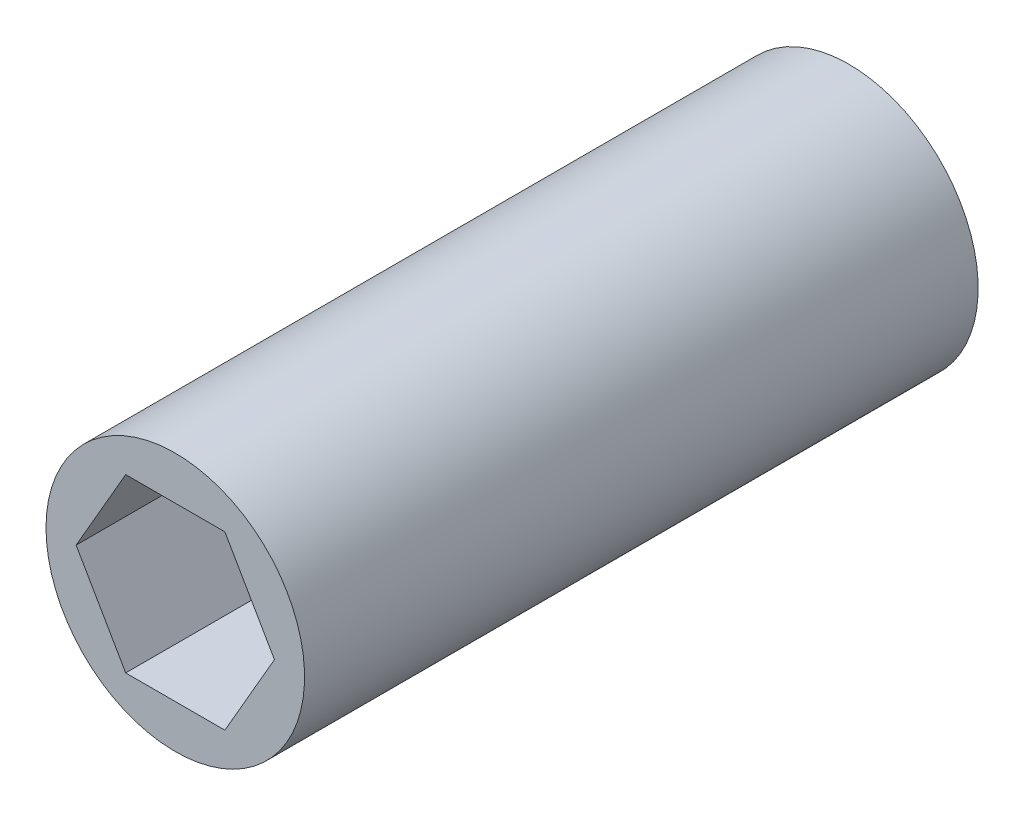
ISO-10303-21;
HEADER;
FILE_DESCRIPTION(('STEP AP214'),'2;1');
FILE_NAME('part.step','',(''),(''),'','','');
FILE_SCHEMA(('AUTOMOTIVE_DESIGN { 1 0 10303 214 1 1 1 1 }'));
ENDSEC;
DATA;
#1=APPLICATION_CONTEXT('core data for automotive mechanical design processes');
#2=APPLICATION_PROTOCOL_DEFINITION('international standard','automotive_design',2000,#1);
#3=PRODUCT_CONTEXT('',#1,'mechanical');
#4=PRODUCT('Part','Part','',(#3));
#5=PRODUCT_RELATED_PRODUCT_CATEGORY('part','',(#4));
#6=PRODUCT_DEFINITION_FORMATION('','',#4);
#7=PRODUCT_DEFINITION_CONTEXT('part definition',#1,'design');
#8=PRODUCT_DEFINITION('design','',#6,#7);
#9=PRODUCT_DEFINITION_SHAPE('','',#8);
#10=(LENGTH_UNIT() NAMED_UNIT(*) SI_UNIT(.MILLI.,.METRE.));
#11=(NAMED_UNIT(*) PLANE_ANGLE_UNIT() SI_UNIT($,.RADIAN.));
#12=(NAMED_UNIT(*) SI_UNIT($,.STERADIAN.) SOLID_ANGLE_UNIT());
#13=UNCERTAINTY_MEASURE_WITH_UNIT(LENGTH_MEASURE(1.E-05),#10,'distance_accuracy_value','');
#14=(GEOMETRIC_REPRESENTATION_CONTEXT(3) GLOBAL_UNCERTAINTY_ASSIGNED_CONTEXT((#13)) GLOBAL_UNIT_ASSIGNED_CONTEXT((#10,
#11,#12)) REPRESENTATION_CONTEXT('',''));
#15=CARTESIAN_POINT('',(0.,0.,0.));
#16=DIRECTION('',(0.,0.,1.));
#17=DIRECTION('',(1.,0.,0.));
#18=AXIS2_PLACEMENT_3D('',#15,#16,#17);
#19=CARTESIAN_POINT('',(-7.47899538708241,0.,25.4));
#20=DIRECTION('',(0.866025403784439,0.5,0.));
#21=DIRECTION('',(-0.5,0.866025403784439,0.));
#22=AXIS2_PLACEMENT_3D('',#19,#20,#21);
#23=PLANE('',#22);
#24=DIRECTION('',(-0.5,0.866025403784438,0.));
#25=VECTOR('',#24,1.);
#26=CARTESIAN_POINT('',(-3.73949769354121,-6.477,25.4));
#27=LINE('',#26,#25);
#28=CARTESIAN_POINT('',(-3.73949769354121,-6.477,25.4));
#29=VERTEX_POINT('',#28);
#30=CARTESIAN_POINT('',(-7.47899538708241,0.,25.4));
#31=VERTEX_POINT('',#30);
#32=EDGE_CURVE('E83',#29,#31,#27,.T.);
#33=ORIENTED_EDGE('',*,*,#32,.F.);
#34=DIRECTION('',(0.,0.,1.));
#35=VECTOR('',#34,1.);
#36=CARTESIAN_POINT('',(-3.73949769354121,-6.477,25.4));
#37=LINE('',#36,#35);
#38=CARTESIAN_POINT('',(-3.73949769354121,-6.477,-25.4));
#39=VERTEX_POINT('',#38);
#40=EDGE_CURVE('E75',#39,#29,#37,.T.);
#41=ORIENTED_EDGE('',*,*,#40,.F.);
#42=DIRECTION('',(-0.5,0.866025403784439,0.));
#43=VECTOR('',#42,1.);
#44=CARTESIAN_POINT('',(-3.73949769354121,-6.477,-25.4));
#45=LINE('',#44,#43);
#46=CARTESIAN_POINT('',(-7.47899538708241,0.,-25.4));
#47=VERTEX_POINT('',#46);
#48=EDGE_CURVE('E115',#39,#47,#45,.T.);
#49=ORIENTED_EDGE('',*,*,#48,.T.);
#50=DIRECTION('',(0.,0.,1.));
#51=VECTOR('',#50,1.);
#52=CARTESIAN_POINT('',(-7.47899538708241,0.,25.4));
#53=LINE('',#52,#51);
#54=EDGE_CURVE('E100',#31,#47,#53,.F.);
#55=ORIENTED_EDGE('',*,*,#54,.F.);
#56=EDGE_LOOP('',(#33,#41,#49,#55));
#57=FACE_BOUND('',#56,.T.);
#58=ADVANCED_FACE('F16',(#57),#23,.T.);
#59=CARTESIAN_POINT('',(-3.73949769354121,6.477,25.4));
#60=DIRECTION('',(0.866025403784439,-0.5,0.));
#61=DIRECTION('',(0.5,0.866025403784439,0.));
#62=AXIS2_PLACEMENT_3D('',#59,#60,#61);
#63=PLANE('',#62);
#64=DIRECTION('',(0.5,0.866025403784439,0.));
#65=VECTOR('',#64,1.);
#66=CARTESIAN_POINT('',(-7.47899538708242,0.,25.4));
#67=LINE('',#66,#65);
#68=CARTESIAN_POINT('',(-3.73949769354121,6.477,25.4));
#69=VERTEX_POINT('',#68);
#70=EDGE_CURVE('E108',#31,#69,#67,.T.);
#71=ORIENTED_EDGE('',*,*,#70,.F.);
#72=ORIENTED_EDGE('',*,*,#54,.T.);
#73=DIRECTION('',(0.5,0.866025403784439,0.));
#74=VECTOR('',#73,1.);
#75=CARTESIAN_POINT('',(-7.47899538708241,0.,-25.4));
#76=LINE('',#75,#74);
#77=CARTESIAN_POINT('',(-3.73949769354121,6.477,-25.4));
#78=VERTEX_POINT('',#77);
#79=EDGE_CURVE('E106',#47,#78,#76,.T.);
#80=ORIENTED_EDGE('',*,*,#79,.T.);
#81=DIRECTION('',(0.,0.,1.));
#82=VECTOR('',#81,1.);
#83=CARTESIAN_POINT('',(-3.73949769354121,6.477,25.4));
#84=LINE('',#83,#82);
#85=EDGE_CURVE('E97',#69,#78,#84,.F.);
#86=ORIENTED_EDGE('',*,*,#85,.F.);
#87=EDGE_LOOP('',(#71,#72,#80,#86));
#88=FACE_BOUND('',#87,.T.);
#89=ADVANCED_FACE('F105',(#88),#63,.T.);
#90=CARTESIAN_POINT('',(3.7394976935412,6.477,25.4));
#91=DIRECTION('',(0.,-1.,0.));
#92=DIRECTION('',(1.,0.,0.));
#93=AXIS2_PLACEMENT_3D('',#90,#91,#92);
#94=PLANE('',#93);
#95=DIRECTION('',(1.,0.,0.));
#96=VECTOR('',#95,1.);
#97=CARTESIAN_POINT('',(0.,6.477,25.4));
#98=LINE('',#97,#96);
#99=CARTESIAN_POINT('',(3.7394976935412,6.477,25.4));
#100=VERTEX_POINT('',#99);
#101=EDGE_CURVE('E125',#69,#100,#98,.T.);
#102=ORIENTED_EDGE('',*,*,#101,.F.);
#103=ORIENTED_EDGE('',*,*,#85,.T.);
#104=DIRECTION('',(1.,0.,0.));
#105=VECTOR('',#104,1.);
#106=CARTESIAN_POINT('',(0.,6.477,-25.4));
#107=LINE('',#106,#105);
#108=CARTESIAN_POINT('',(3.7394976935412,6.477,-25.4));
#109=VERTEX_POINT('',#108);
#110=EDGE_CURVE('E117',#78,#109,#107,.T.);
#111=ORIENTED_EDGE('',*,*,#110,.T.);
#112=DIRECTION('',(0.,0.,1.));
#113=VECTOR('',#112,1.);
#114=CARTESIAN_POINT('',(3.7394976935412,6.47700000000001,25.4));
#115=LINE('',#114,#113);
#116=EDGE_CURVE('E94',#100,#109,#115,.F.);
#117=ORIENTED_EDGE('',*,*,#116,.F.);
#118=EDGE_LOOP('',(#102,#103,#111,#117));
#119=FACE_BOUND('',#118,.T.);
#120=ADVANCED_FACE('F134',(#119),#94,.T.);
#121=CARTESIAN_POINT('',(7.47899538708241,0.,25.4));
#122=DIRECTION('',(-0.866025403784439,-0.5,0.));
#123=DIRECTION('',(0.5,-0.866025403784439,0.));
#124=AXIS2_PLACEMENT_3D('',#121,#122,#123);
#125=PLANE('',#124);
#126=DIRECTION('',(0.5,-0.866025403784438,0.));
#127=VECTOR('',#126,1.);
#128=CARTESIAN_POINT('',(3.7394976935412,6.477,25.4));
#129=LINE('',#128,#127);
#130=CARTESIAN_POINT('',(7.47899538708242,0.,25.4));
#131=VERTEX_POINT('',#130);
#132=EDGE_CURVE('E88',#100,#131,#129,.T.);
#133=ORIENTED_EDGE('',*,*,#132,.F.);
#134=ORIENTED_EDGE('',*,*,#116,.T.);
#135=DIRECTION('',(0.5,-0.866025403784438,0.));
#136=VECTOR('',#135,1.);
#137=CARTESIAN_POINT('',(3.7394976935412,6.477,-25.4));
#138=LINE('',#137,#136);
#139=CARTESIAN_POINT('',(7.47899538708241,0.,-25.4));
#140=VERTEX_POINT('',#139);
#141=EDGE_CURVE('E119',#109,#140,#138,.T.);
#142=ORIENTED_EDGE('',*,*,#141,.T.);
#143=DIRECTION('',(0.,0.,1.));
#144=VECTOR('',#143,1.);
#145=CARTESIAN_POINT('',(7.47899538708242,0.,25.4));
#146=LINE('',#145,#144);
#147=EDGE_CURVE('E64',#131,#140,#146,.F.);
#148=ORIENTED_EDGE('',*,*,#147,.F.);
#149=EDGE_LOOP('',(#133,#134,#142,#148));
#150=FACE_BOUND('',#149,.T.);
#151=ADVANCED_FACE('F131',(#150),#125,.T.);
#152=CARTESIAN_POINT('',(3.73949769354121,-6.477,25.4));
#153=DIRECTION('',(-0.866025403784439,0.5,0.));
#154=DIRECTION('',(-0.5,-0.866025403784439,0.));
#155=AXIS2_PLACEMENT_3D('',#152,#153,#154);
#156=PLANE('',#155);
#157=DIRECTION('',(-0.5,-0.866025403784439,0.));
#158=VECTOR('',#157,1.);
#159=CARTESIAN_POINT('',(7.47899538708241,0.,25.4));
#160=LINE('',#159,#158);
#161=CARTESIAN_POINT('',(3.73949769354121,-6.477,25.4));
#162=VERTEX_POINT('',#161);
#163=EDGE_CURVE('E70',#131,#162,#160,.T.);
#164=ORIENTED_EDGE('',*,*,#163,.F.);
#165=ORIENTED_EDGE('',*,*,#147,.T.);
#166=DIRECTION('',(-0.5,-0.866025403784439,0.));
#167=VECTOR('',#166,1.);
#168=CARTESIAN_POINT('',(7.47899538708241,0.,-25.4));
#169=LINE('',#168,#167);
#170=CARTESIAN_POINT('',(3.73949769354121,-6.477,-25.4));
#171=VERTEX_POINT('',#170);
#172=EDGE_CURVE('E32',#140,#171,#169,.T.);
#173=ORIENTED_EDGE('',*,*,#172,.T.);
#174=DIRECTION('',(0.,0.,1.));
#175=VECTOR('',#174,1.);
#176=CARTESIAN_POINT('',(3.73949769354121,-6.477,25.4));
#177=LINE('',#176,#175);
#178=EDGE_CURVE('E66',#162,#171,#177,.F.);
#179=ORIENTED_EDGE('',*,*,#178,.F.);
#180=EDGE_LOOP('',(#164,#165,#173,#179));
#181=FACE_BOUND('',#180,.T.);
#182=ADVANCED_FACE('F68',(#181),#156,.T.);
#183=CARTESIAN_POINT('',(-3.73949769354121,-6.477,25.4));
#184=DIRECTION('',(0.,1.,0.));
#185=DIRECTION('',(0.,0.,1.));
#186=AXIS2_PLACEMENT_3D('',#183,#184,#185);
#187=PLANE('',#186);
#188=DIRECTION('',(1.,0.,0.));
#189=VECTOR('',#188,1.);
#190=CARTESIAN_POINT('',(0.,-6.477,25.4));
#191=LINE('',#190,#189);
#192=EDGE_CURVE('E78',#162,#29,#191,.F.);
#193=ORIENTED_EDGE('',*,*,#192,.F.);
#194=ORIENTED_EDGE('',*,*,#178,.T.);
#195=DIRECTION('',(1.,0.,0.));
#196=VECTOR('',#195,1.);
#197=CARTESIAN_POINT('',(0.,-6.477,-25.4));
#198=LINE('',#197,#196);
#199=EDGE_CURVE('E127',#171,#39,#198,.F.);
#200=ORIENTED_EDGE('',*,*,#199,.T.);
#201=ORIENTED_EDGE('',*,*,#40,.T.);
#202=EDGE_LOOP('',(#193,#194,#200,#201));
#203=FACE_BOUND('',#202,.T.);
#204=ADVANCED_FACE('F79',(#203),#187,.T.);
#205=CARTESIAN_POINT('',(0.,0.,25.4));
#206=DIRECTION('',(0.,0.,1.));
#207=DIRECTION('',(1.,0.,0.));
#208=AXIS2_PLACEMENT_3D('',#205,#206,#207);
#209=PLANE('',#208);
#210=ORIENTED_EDGE('',*,*,#101,.T.);
#211=ORIENTED_EDGE('',*,*,#132,.T.);
#212=ORIENTED_EDGE('',*,*,#163,.T.);
#213=ORIENTED_EDGE('',*,*,#192,.T.);
#214=ORIENTED_EDGE('',*,*,#32,.T.);
#215=ORIENTED_EDGE('',*,*,#70,.T.);
#216=EDGE_LOOP('',(#210,#211,#212,#213,#214,#215));
#217=FACE_BOUND('',#216,.T.);
#218=CARTESIAN_POINT('',(0.,0.,25.4));
#219=DIRECTION('',(0.,0.,-1.));
#220=DIRECTION('',(-1.,0.,0.));
#221=AXIS2_PLACEMENT_3D('',#218,#219,#220);
#222=CIRCLE('',#221,9.75);
#223=CARTESIAN_POINT('',(-9.75,0.,25.4));
#224=VERTEX_POINT('',#223);
#225=EDGE_CURVE('E19',#224,#224,#222,.T.);
#226=ORIENTED_EDGE('',*,*,#225,.F.);
#227=EDGE_LOOP('',(#226));
#228=FACE_BOUND('',#227,.T.);
#229=ADVANCED_FACE('F86',(#217,#228),#209,.T.);
#230=CARTESIAN_POINT('',(0.,0.,-25.4));
#231=DIRECTION('',(0.,0.,1.));
#232=DIRECTION('',(1.,0.,0.));
#233=AXIS2_PLACEMENT_3D('',#230,#231,#232);
#234=PLANE('',#233);
#235=ORIENTED_EDGE('',*,*,#172,.F.);
#236=ORIENTED_EDGE('',*,*,#141,.F.);
#237=ORIENTED_EDGE('',*,*,#110,.F.);
#238=ORIENTED_EDGE('',*,*,#79,.F.);
#239=ORIENTED_EDGE('',*,*,#48,.F.);
#240=ORIENTED_EDGE('',*,*,#199,.F.);
#241=EDGE_LOOP('',(#235,#236,#237,#238,#239,#240));
#242=FACE_BOUND('',#241,.T.);
#243=CARTESIAN_POINT('',(0.,0.,-25.4));
#244=DIRECTION('',(0.,0.,-1.));
#245=DIRECTION('',(-1.,0.,0.));
#246=AXIS2_PLACEMENT_3D('',#243,#244,#245);
#247=CIRCLE('',#246,9.75);
#248=CARTESIAN_POINT('',(-9.75,0.,-25.4));
#249=VERTEX_POINT('',#248);
#250=EDGE_CURVE('E10',#249,#249,#247,.F.);
#251=ORIENTED_EDGE('',*,*,#250,.F.);
#252=EDGE_LOOP('',(#251));
#253=FACE_BOUND('',#252,.T.);
#254=ADVANCED_FACE('F113',(#242,#253),#234,.F.);
#255=CARTESIAN_POINT('',(0.,0.,25.4));
#256=DIRECTION('',(0.,0.,-1.));
#257=DIRECTION('',(-1.,0.,0.));
#258=AXIS2_PLACEMENT_3D('',#255,#256,#257);
#259=CYLINDRICAL_SURFACE('',#258,9.75);
#260=ORIENTED_EDGE('',*,*,#250,.T.);
#261=EDGE_LOOP('',(#260));
#262=FACE_BOUND('',#261,.T.);
#263=ORIENTED_EDGE('',*,*,#225,.T.);
#264=EDGE_LOOP('',(#263));
#265=FACE_BOUND('',#264,.T.);
#266=ADVANCED_FACE('F143',(#262,#265),#259,.T.);
#267=CLOSED_SHELL('',(#58,#89,#120,#151,#182,#204,#229,#254,#266));
#268=MANIFOLD_SOLID_BREP('B1',#267);
#269=ADVANCED_BREP_SHAPE_REPRESENTATION('',(#18,#268),#14);
#270=SHAPE_DEFINITION_REPRESENTATION(#9,#269);
ENDSEC;
END-ISO-10303-21;
